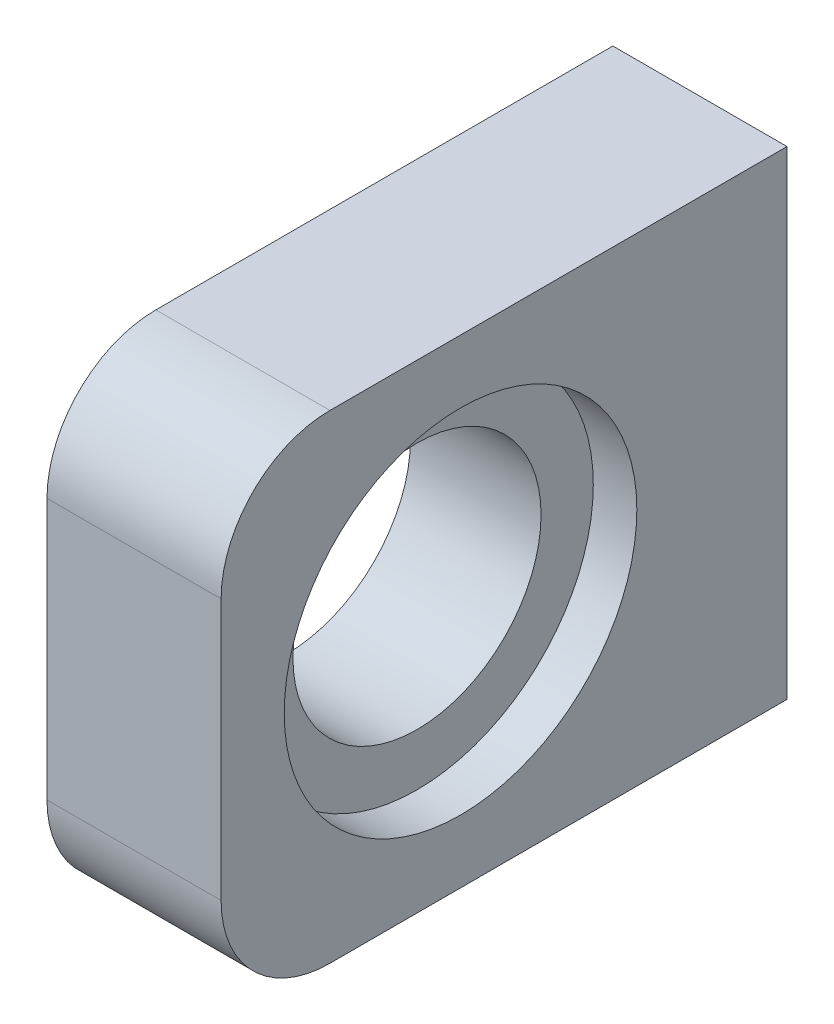
ISO-10303-21;
HEADER;
FILE_DESCRIPTION(('STEP AP214'),'2;1');
FILE_NAME('part.step','',(''),(''),'','','');
FILE_SCHEMA(('AUTOMOTIVE_DESIGN { 1 0 10303 214 1 1 1 1 }'));
ENDSEC;
DATA;
#1=APPLICATION_CONTEXT('core data for automotive mechanical design processes');
#2=APPLICATION_PROTOCOL_DEFINITION('international standard','automotive_design',2000,#1);
#3=PRODUCT_CONTEXT('',#1,'mechanical');
#4=PRODUCT('Part','Part','',(#3));
#5=PRODUCT_RELATED_PRODUCT_CATEGORY('part','',(#4));
#6=PRODUCT_DEFINITION_FORMATION('','',#4);
#7=PRODUCT_DEFINITION_CONTEXT('part definition',#1,'design');
#8=PRODUCT_DEFINITION('design','',#6,#7);
#9=PRODUCT_DEFINITION_SHAPE('','',#8);
#10=(LENGTH_UNIT() NAMED_UNIT(*) SI_UNIT(.MILLI.,.METRE.));
#11=(NAMED_UNIT(*) PLANE_ANGLE_UNIT() SI_UNIT($,.RADIAN.));
#12=(NAMED_UNIT(*) SI_UNIT($,.STERADIAN.) SOLID_ANGLE_UNIT());
#13=UNCERTAINTY_MEASURE_WITH_UNIT(LENGTH_MEASURE(1.E-05),#10,'distance_accuracy_value','');
#14=(GEOMETRIC_REPRESENTATION_CONTEXT(3) GLOBAL_UNCERTAINTY_ASSIGNED_CONTEXT((#13)) GLOBAL_UNIT_ASSIGNED_CONTEXT((#10,
#11,#12)) REPRESENTATION_CONTEXT('',''));
#15=CARTESIAN_POINT('',(0.,0.,0.));
#16=DIRECTION('',(0.,0.,1.));
#17=DIRECTION('',(1.,0.,0.));
#18=AXIS2_PLACEMENT_3D('',#15,#16,#17);
#19=CARTESIAN_POINT('',(0.,22.,-4.));
#20=DIRECTION('',(0.,1.,0.));
#21=DIRECTION('',(0.,0.,1.));
#22=AXIS2_PLACEMENT_3D('',#19,#20,#21);
#23=PLANE('',#22);
#24=DIRECTION('',(0.,0.,1.));
#25=VECTOR('',#24,1.);
#26=CARTESIAN_POINT('',(0.,22.,-4.));
#27=LINE('',#26,#25);
#28=CARTESIAN_POINT('',(0.,22.,-4.));
#29=VERTEX_POINT('',#28);
#30=CARTESIAN_POINT('',(0.,22.,17.));
#31=VERTEX_POINT('',#30);
#32=EDGE_CURVE('E119',#29,#31,#27,.T.);
#33=ORIENTED_EDGE('',*,*,#32,.T.);
#34=DIRECTION('',(1.,0.,0.));
#35=VECTOR('',#34,1.);
#36=CARTESIAN_POINT('',(0.,22.,17.));
#37=LINE('',#36,#35);
#38=CARTESIAN_POINT('',(8.,22.,17.));
#39=VERTEX_POINT('',#38);
#40=EDGE_CURVE('E142',#31,#39,#37,.T.);
#41=ORIENTED_EDGE('',*,*,#40,.T.);
#42=DIRECTION('',(0.,0.,1.));
#43=VECTOR('',#42,1.);
#44=CARTESIAN_POINT('',(8.,22.,-4.));
#45=LINE('',#44,#43);
#46=CARTESIAN_POINT('',(8.,22.,-4.));
#47=VERTEX_POINT('',#46);
#48=EDGE_CURVE('E116',#47,#39,#45,.T.);
#49=ORIENTED_EDGE('',*,*,#48,.F.);
#50=DIRECTION('',(1.,0.,0.));
#51=VECTOR('',#50,1.);
#52=CARTESIAN_POINT('',(0.,22.,-4.));
#53=LINE('',#52,#51);
#54=EDGE_CURVE('E140',#29,#47,#53,.T.);
#55=ORIENTED_EDGE('',*,*,#54,.F.);
#56=EDGE_LOOP('',(#33,#41,#49,#55));
#57=FACE_BOUND('',#56,.T.);
#58=ADVANCED_FACE('F32',(#57),#23,.T.);
#59=CARTESIAN_POINT('',(0.,0.,-4.));
#60=DIRECTION('',(0.,0.,-1.));
#61=DIRECTION('',(0.,1.,0.));
#62=AXIS2_PLACEMENT_3D('',#59,#60,#61);
#63=PLANE('',#62);
#64=CARTESIAN_POINT('',(4.,16.,-4.));
#65=DIRECTION('',(0.,0.,-1.));
#66=DIRECTION('',(0.,1.,0.));
#67=AXIS2_PLACEMENT_3D('',#64,#65,#66);
#68=CIRCLE('',#67,1.64999999999999);
#69=CARTESIAN_POINT('',(4.,17.65,-4.));
#70=VERTEX_POINT('',#69);
#71=EDGE_CURVE('E100',#70,#70,#68,.T.);
#72=ORIENTED_EDGE('',*,*,#71,.F.);
#73=EDGE_LOOP('',(#72));
#74=FACE_BOUND('',#73,.T.);
#75=CARTESIAN_POINT('',(4.,6.,-4.));
#76=DIRECTION('',(0.,0.,-1.));
#77=DIRECTION('',(0.,1.,0.));
#78=AXIS2_PLACEMENT_3D('',#75,#76,#77);
#79=CIRCLE('',#78,1.64999999999999);
#80=CARTESIAN_POINT('',(4.,7.64999999999999,-4.));
#81=VERTEX_POINT('',#80);
#82=EDGE_CURVE('E99',#81,#81,#79,.T.);
#83=ORIENTED_EDGE('',*,*,#82,.F.);
#84=EDGE_LOOP('',(#83));
#85=FACE_BOUND('',#84,.T.);
#86=DIRECTION('',(0.,1.,0.));
#87=VECTOR('',#86,1.);
#88=CARTESIAN_POINT('',(8.,0.,-4.));
#89=LINE('',#88,#87);
#90=CARTESIAN_POINT('',(8.,0.,-4.));
#91=VERTEX_POINT('',#90);
#92=EDGE_CURVE('E123',#91,#47,#89,.T.);
#93=ORIENTED_EDGE('',*,*,#92,.F.);
#94=DIRECTION('',(1.,0.,0.));
#95=VECTOR('',#94,1.);
#96=CARTESIAN_POINT('',(0.,0.,-4.));
#97=LINE('',#96,#95);
#98=CARTESIAN_POINT('',(0.,0.,-4.));
#99=VERTEX_POINT('',#98);
#100=EDGE_CURVE('E130',#99,#91,#97,.T.);
#101=ORIENTED_EDGE('',*,*,#100,.F.);
#102=DIRECTION('',(0.,1.,0.));
#103=VECTOR('',#102,1.);
#104=CARTESIAN_POINT('',(0.,0.,-4.));
#105=LINE('',#104,#103);
#106=EDGE_CURVE('E127',#99,#29,#105,.T.);
#107=ORIENTED_EDGE('',*,*,#106,.T.);
#108=ORIENTED_EDGE('',*,*,#54,.T.);
#109=EDGE_LOOP('',(#93,#101,#107,#108));
#110=FACE_BOUND('',#109,.T.);
#111=ADVANCED_FACE('F177',(#74,#85,#110),#63,.T.);
#112=CARTESIAN_POINT('',(0.,0.,22.));
#113=DIRECTION('',(0.,-1.,0.));
#114=DIRECTION('',(0.,0.,-1.));
#115=AXIS2_PLACEMENT_3D('',#112,#113,#114);
#116=PLANE('',#115);
#117=DIRECTION('',(0.,0.,-1.));
#118=VECTOR('',#117,1.);
#119=CARTESIAN_POINT('',(8.,0.,22.));
#120=LINE('',#119,#118);
#121=CARTESIAN_POINT('',(8.,0.,17.));
#122=VERTEX_POINT('',#121);
#123=EDGE_CURVE('E136',#122,#91,#120,.T.);
#124=ORIENTED_EDGE('',*,*,#123,.F.);
#125=DIRECTION('',(1.,0.,0.));
#126=VECTOR('',#125,1.);
#127=CARTESIAN_POINT('',(0.,0.,17.));
#128=LINE('',#127,#126);
#129=CARTESIAN_POINT('',(0.,0.,17.));
#130=VERTEX_POINT('',#129);
#131=EDGE_CURVE('E11',#122,#130,#128,.F.);
#132=ORIENTED_EDGE('',*,*,#131,.T.);
#133=DIRECTION('',(0.,0.,-1.));
#134=VECTOR('',#133,1.);
#135=CARTESIAN_POINT('',(0.,0.,22.));
#136=LINE('',#135,#134);
#137=EDGE_CURVE('E125',#130,#99,#136,.T.);
#138=ORIENTED_EDGE('',*,*,#137,.T.);
#139=ORIENTED_EDGE('',*,*,#100,.T.);
#140=EDGE_LOOP('',(#124,#132,#138,#139));
#141=FACE_BOUND('',#140,.T.);
#142=ADVANCED_FACE('F173',(#141),#116,.T.);
#143=CARTESIAN_POINT('',(0.,22.,22.));
#144=DIRECTION('',(0.,0.,1.));
#145=DIRECTION('',(1.,0.,0.));
#146=AXIS2_PLACEMENT_3D('',#143,#144,#145);
#147=PLANE('',#146);
#148=DIRECTION('',(0.,-1.,0.));
#149=VECTOR('',#148,1.);
#150=CARTESIAN_POINT('',(8.,22.,22.));
#151=LINE('',#150,#149);
#152=CARTESIAN_POINT('',(8.,17.,22.));
#153=VERTEX_POINT('',#152);
#154=CARTESIAN_POINT('',(8.,5.,22.));
#155=VERTEX_POINT('',#154);
#156=EDGE_CURVE('E133',#153,#155,#151,.T.);
#157=ORIENTED_EDGE('',*,*,#156,.F.);
#158=DIRECTION('',(1.,0.,0.));
#159=VECTOR('',#158,1.);
#160=CARTESIAN_POINT('',(0.,17.,22.));
#161=LINE('',#160,#159);
#162=CARTESIAN_POINT('',(0.,17.,22.));
#163=VERTEX_POINT('',#162);
#164=EDGE_CURVE('E154',#153,#163,#161,.F.);
#165=ORIENTED_EDGE('',*,*,#164,.T.);
#166=DIRECTION('',(0.,-1.,0.));
#167=VECTOR('',#166,1.);
#168=CARTESIAN_POINT('',(0.,22.,22.));
#169=LINE('',#168,#167);
#170=CARTESIAN_POINT('',(0.,5.,22.));
#171=VERTEX_POINT('',#170);
#172=EDGE_CURVE('E122',#163,#171,#169,.T.);
#173=ORIENTED_EDGE('',*,*,#172,.T.);
#174=DIRECTION('',(1.,0.,0.));
#175=VECTOR('',#174,1.);
#176=CARTESIAN_POINT('',(0.,5.,22.));
#177=LINE('',#176,#175);
#178=EDGE_CURVE('E151',#171,#155,#177,.T.);
#179=ORIENTED_EDGE('',*,*,#178,.T.);
#180=EDGE_LOOP('',(#157,#165,#173,#179));
#181=FACE_BOUND('',#180,.T.);
#182=ADVANCED_FACE('F170',(#181),#147,.T.);
#183=CARTESIAN_POINT('',(0.,0.,0.));
#184=DIRECTION('',(1.,0.,0.));
#185=DIRECTION('',(0.,0.,-1.));
#186=AXIS2_PLACEMENT_3D('',#183,#184,#185);
#187=PLANE('',#186);
#188=CARTESIAN_POINT('',(0.,11.,11.));
#189=DIRECTION('',(1.,0.,0.));
#190=DIRECTION('',(0.,0.,-1.));
#191=AXIS2_PLACEMENT_3D('',#188,#189,#190);
#192=CIRCLE('',#191,5.69999999999999);
#193=CARTESIAN_POINT('',(0.,11.,5.30000000000001));
#194=VERTEX_POINT('',#193);
#195=EDGE_CURVE('E106',#194,#194,#192,.T.);
#196=ORIENTED_EDGE('',*,*,#195,.T.);
#197=EDGE_LOOP('',(#196));
#198=FACE_BOUND('',#197,.T.);
#199=ORIENTED_EDGE('',*,*,#172,.F.);
#200=CARTESIAN_POINT('',(0.,17.,17.));
#201=DIRECTION('',(1.,0.,0.));
#202=DIRECTION('',(0.,0.,-1.));
#203=AXIS2_PLACEMENT_3D('',#200,#201,#202);
#204=CIRCLE('',#203,5.);
#205=EDGE_CURVE('E40',#163,#31,#204,.F.);
#206=ORIENTED_EDGE('',*,*,#205,.T.);
#207=ORIENTED_EDGE('',*,*,#32,.F.);
#208=ORIENTED_EDGE('',*,*,#106,.F.);
#209=ORIENTED_EDGE('',*,*,#137,.F.);
#210=CARTESIAN_POINT('',(0.,5.,17.));
#211=DIRECTION('',(1.,0.,0.));
#212=DIRECTION('',(0.,0.,-1.));
#213=AXIS2_PLACEMENT_3D('',#210,#211,#212);
#214=CIRCLE('',#213,5.);
#215=EDGE_CURVE('E52',#130,#171,#214,.F.);
#216=ORIENTED_EDGE('',*,*,#215,.T.);
#217=EDGE_LOOP('',(#199,#206,#207,#208,#209,#216));
#218=FACE_BOUND('',#217,.T.);
#219=ADVANCED_FACE('F158',(#198,#218),#187,.F.);
#220=CARTESIAN_POINT('',(8.,0.,0.));
#221=DIRECTION('',(1.,0.,0.));
#222=DIRECTION('',(0.,0.,-1.));
#223=AXIS2_PLACEMENT_3D('',#220,#221,#222);
#224=PLANE('',#223);
#225=CARTESIAN_POINT('',(8.,11.,11.));
#226=DIRECTION('',(1.,0.,0.));
#227=DIRECTION('',(0.,0.,-1.));
#228=AXIS2_PLACEMENT_3D('',#225,#226,#227);
#229=CIRCLE('',#228,8.1);
#230=CARTESIAN_POINT('',(8.,11.,2.9));
#231=VERTEX_POINT('',#230);
#232=EDGE_CURVE('E112',#231,#231,#229,.T.);
#233=ORIENTED_EDGE('',*,*,#232,.F.);
#234=EDGE_LOOP('',(#233));
#235=FACE_BOUND('',#234,.T.);
#236=ORIENTED_EDGE('',*,*,#48,.T.);
#237=CARTESIAN_POINT('',(8.,17.,17.));
#238=DIRECTION('',(1.,0.,0.));
#239=DIRECTION('',(0.,0.,-1.));
#240=AXIS2_PLACEMENT_3D('',#237,#238,#239);
#241=CIRCLE('',#240,5.);
#242=EDGE_CURVE('E149',#39,#153,#241,.T.);
#243=ORIENTED_EDGE('',*,*,#242,.T.);
#244=ORIENTED_EDGE('',*,*,#156,.T.);
#245=CARTESIAN_POINT('',(8.,5.,17.));
#246=DIRECTION('',(1.,0.,0.));
#247=DIRECTION('',(0.,0.,-1.));
#248=AXIS2_PLACEMENT_3D('',#245,#246,#247);
#249=CIRCLE('',#248,5.);
#250=EDGE_CURVE('E147',#155,#122,#249,.T.);
#251=ORIENTED_EDGE('',*,*,#250,.T.);
#252=ORIENTED_EDGE('',*,*,#123,.T.);
#253=ORIENTED_EDGE('',*,*,#92,.T.);
#254=EDGE_LOOP('',(#236,#243,#244,#251,#252,#253));
#255=FACE_BOUND('',#254,.T.);
#256=ADVANCED_FACE('F168',(#235,#255),#224,.T.);
#257=CARTESIAN_POINT('',(6.,11.,11.));
#258=DIRECTION('',(1.,0.,0.));
#259=DIRECTION('',(0.,0.,-1.));
#260=AXIS2_PLACEMENT_3D('',#257,#258,#259);
#261=CYLINDRICAL_SURFACE('',#260,8.1);
#262=CARTESIAN_POINT('',(6.,11.,11.));
#263=DIRECTION('',(1.,0.,0.));
#264=DIRECTION('',(0.,0.,-1.));
#265=AXIS2_PLACEMENT_3D('',#262,#263,#264);
#266=CIRCLE('',#265,8.1);
#267=CARTESIAN_POINT('',(6.,11.,2.9));
#268=VERTEX_POINT('',#267);
#269=EDGE_CURVE('E113',#268,#268,#266,.T.);
#270=ORIENTED_EDGE('',*,*,#269,.F.);
#271=EDGE_LOOP('',(#270));
#272=FACE_BOUND('',#271,.T.);
#273=ORIENTED_EDGE('',*,*,#232,.T.);
#274=EDGE_LOOP('',(#273));
#275=FACE_BOUND('',#274,.T.);
#276=ADVANCED_FACE('F218',(#272,#275),#261,.F.);
#277=CARTESIAN_POINT('',(6.,11.,11.));
#278=DIRECTION('',(1.,0.,0.));
#279=DIRECTION('',(0.,0.,-1.));
#280=AXIS2_PLACEMENT_3D('',#277,#278,#279);
#281=PLANE('',#280);
#282=CARTESIAN_POINT('',(6.,11.,11.));
#283=DIRECTION('',(1.,0.,0.));
#284=DIRECTION('',(0.,0.,-1.));
#285=AXIS2_PLACEMENT_3D('',#282,#283,#284);
#286=CIRCLE('',#285,5.69999999999999);
#287=CARTESIAN_POINT('',(6.,11.,5.30000000000001));
#288=VERTEX_POINT('',#287);
#289=EDGE_CURVE('E229',#288,#288,#286,.T.);
#290=ORIENTED_EDGE('',*,*,#289,.F.);
#291=EDGE_LOOP('',(#290));
#292=FACE_BOUND('',#291,.T.);
#293=ORIENTED_EDGE('',*,*,#269,.T.);
#294=EDGE_LOOP('',(#293));
#295=FACE_BOUND('',#294,.T.);
#296=ADVANCED_FACE('F214',(#292,#295),#281,.T.);
#297=CARTESIAN_POINT('',(4.,6.,2.00000000000001));
#298=DIRECTION('',(0.,0.,-1.));
#299=DIRECTION('',(0.,1.,0.));
#300=AXIS2_PLACEMENT_3D('',#297,#298,#299);
#301=CONICAL_SURFACE('',#300,1.64999999999999,1.02974425885275);
#302=CARTESIAN_POINT('',(4.,6.,2.99142002100001));
#303=VERTEX_POINT('',#302);
#304=VERTEX_LOOP('',#303);
#305=FACE_BOUND('',#304,.T.);
#306=CARTESIAN_POINT('',(4.,6.,2.00000000000001));
#307=DIRECTION('',(0.,0.,-1.));
#308=DIRECTION('',(0.,1.,0.));
#309=AXIS2_PLACEMENT_3D('',#306,#307,#308);
#310=CIRCLE('',#309,1.64999999999999);
#311=CARTESIAN_POINT('',(4.,7.64999999999999,2.00000000000001));
#312=VERTEX_POINT('',#311);
#313=EDGE_CURVE('E103',#312,#312,#310,.T.);
#314=ORIENTED_EDGE('',*,*,#313,.T.);
#315=EDGE_LOOP('',(#314));
#316=FACE_BOUND('',#315,.T.);
#317=ADVANCED_FACE('F210',(#305,#316),#301,.F.);
#318=CARTESIAN_POINT('',(4.,6.,-4.));
#319=DIRECTION('',(0.,0.,-1.));
#320=DIRECTION('',(0.,1.,0.));
#321=AXIS2_PLACEMENT_3D('',#318,#319,#320);
#322=CYLINDRICAL_SURFACE('',#321,1.64999999999999);
#323=ORIENTED_EDGE('',*,*,#313,.F.);
#324=EDGE_LOOP('',(#323));
#325=FACE_BOUND('',#324,.T.);
#326=ORIENTED_EDGE('',*,*,#82,.T.);
#327=EDGE_LOOP('',(#326));
#328=FACE_BOUND('',#327,.T.);
#329=ADVANCED_FACE('F93',(#325,#328),#322,.F.);
#330=CARTESIAN_POINT('',(4.,16.,2.00000000000001));
#331=DIRECTION('',(0.,0.,-1.));
#332=DIRECTION('',(0.,1.,0.));
#333=AXIS2_PLACEMENT_3D('',#330,#331,#332);
#334=CONICAL_SURFACE('',#333,1.64999999999999,1.02974425885275);
#335=CARTESIAN_POINT('',(4.,16.,2.99142002100001));
#336=VERTEX_POINT('',#335);
#337=VERTEX_LOOP('',#336);
#338=FACE_BOUND('',#337,.T.);
#339=CARTESIAN_POINT('',(4.,16.,2.00000000000001));
#340=DIRECTION('',(0.,0.,-1.));
#341=DIRECTION('',(0.,1.,0.));
#342=AXIS2_PLACEMENT_3D('',#339,#340,#341);
#343=CIRCLE('',#342,1.64999999999999);
#344=CARTESIAN_POINT('',(4.,17.65,2.00000000000001));
#345=VERTEX_POINT('',#344);
#346=EDGE_CURVE('E97',#345,#345,#343,.T.);
#347=ORIENTED_EDGE('',*,*,#346,.T.);
#348=EDGE_LOOP('',(#347));
#349=FACE_BOUND('',#348,.T.);
#350=ADVANCED_FACE('F89',(#338,#349),#334,.F.);
#351=CARTESIAN_POINT('',(4.,16.,-4.));
#352=DIRECTION('',(0.,0.,-1.));
#353=DIRECTION('',(0.,1.,0.));
#354=AXIS2_PLACEMENT_3D('',#351,#352,#353);
#355=CYLINDRICAL_SURFACE('',#354,1.64999999999999);
#356=ORIENTED_EDGE('',*,*,#346,.F.);
#357=EDGE_LOOP('',(#356));
#358=FACE_BOUND('',#357,.T.);
#359=ORIENTED_EDGE('',*,*,#71,.T.);
#360=EDGE_LOOP('',(#359));
#361=FACE_BOUND('',#360,.T.);
#362=ADVANCED_FACE('F92',(#358,#361),#355,.F.);
#363=CARTESIAN_POINT('',(6.,11.,11.));
#364=DIRECTION('',(1.,0.,0.));
#365=DIRECTION('',(0.,0.,-1.));
#366=AXIS2_PLACEMENT_3D('',#363,#364,#365);
#367=CYLINDRICAL_SURFACE('',#366,5.69999999999999);
#368=ORIENTED_EDGE('',*,*,#195,.F.);
#369=EDGE_LOOP('',(#368));
#370=FACE_BOUND('',#369,.T.);
#371=ORIENTED_EDGE('',*,*,#289,.T.);
#372=EDGE_LOOP('',(#371));
#373=FACE_BOUND('',#372,.T.);
#374=ADVANCED_FACE('F194',(#370,#373),#367,.F.);
#375=CARTESIAN_POINT('',(0.,17.,17.));
#376=DIRECTION('',(1.,0.,0.));
#377=DIRECTION('',(0.,0.,-1.));
#378=AXIS2_PLACEMENT_3D('',#375,#376,#377);
#379=CYLINDRICAL_SURFACE('',#378,5.);
#380=ORIENTED_EDGE('',*,*,#205,.F.);
#381=ORIENTED_EDGE('',*,*,#164,.F.);
#382=ORIENTED_EDGE('',*,*,#242,.F.);
#383=ORIENTED_EDGE('',*,*,#40,.F.);
#384=EDGE_LOOP('',(#380,#381,#382,#383));
#385=FACE_BOUND('',#384,.T.);
#386=ADVANCED_FACE('F165',(#385),#379,.T.);
#387=CARTESIAN_POINT('',(0.,5.,17.));
#388=DIRECTION('',(1.,0.,0.));
#389=DIRECTION('',(0.,0.,-1.));
#390=AXIS2_PLACEMENT_3D('',#387,#388,#389);
#391=CYLINDRICAL_SURFACE('',#390,5.);
#392=ORIENTED_EDGE('',*,*,#215,.F.);
#393=ORIENTED_EDGE('',*,*,#131,.F.);
#394=ORIENTED_EDGE('',*,*,#250,.F.);
#395=ORIENTED_EDGE('',*,*,#178,.F.);
#396=EDGE_LOOP('',(#392,#393,#394,#395));
#397=FACE_BOUND('',#396,.T.);
#398=ADVANCED_FACE('F34',(#397),#391,.T.);
#399=CLOSED_SHELL('',(#58,#111,#142,#182,#219,#256,#276,#296,#317,#329,#350,#362,#374,#386,#398));
#400=MANIFOLD_SOLID_BREP('B2',#399);
#401=ADVANCED_BREP_SHAPE_REPRESENTATION('',(#18,#400),#14);
#402=SHAPE_DEFINITION_REPRESENTATION(#9,#401);
ENDSEC;
END-ISO-10303-21;
